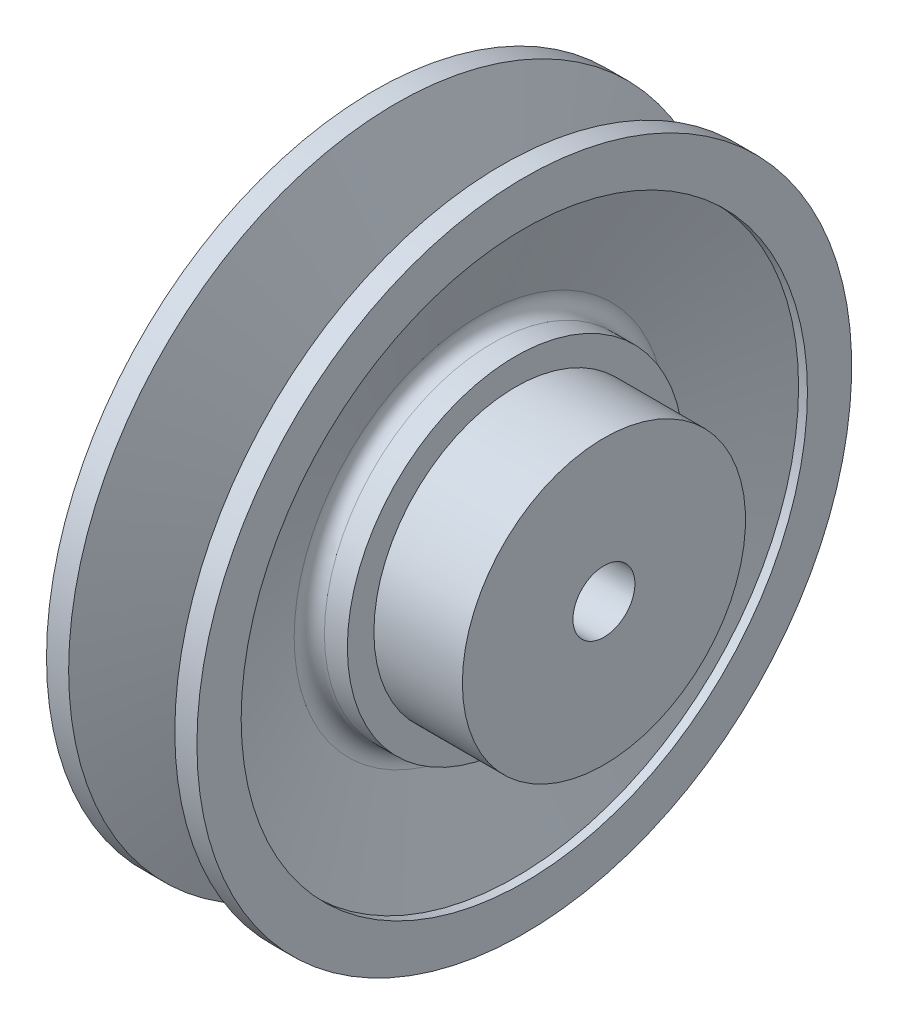
ISO-10303-21;
HEADER;
FILE_DESCRIPTION(('STEP AP214'),'2;1');
FILE_NAME('part.step','',(''),(''),'','','');
FILE_SCHEMA(('AUTOMOTIVE_DESIGN { 1 0 10303 214 1 1 1 1 }'));
ENDSEC;
DATA;
#1=APPLICATION_CONTEXT('core data for automotive mechanical design processes');
#2=APPLICATION_PROTOCOL_DEFINITION('international standard','automotive_design',2000,#1);
#3=PRODUCT_CONTEXT('',#1,'mechanical');
#4=PRODUCT('Part','Part','',(#3));
#5=PRODUCT_RELATED_PRODUCT_CATEGORY('part','',(#4));
#6=PRODUCT_DEFINITION_FORMATION('','',#4);
#7=PRODUCT_DEFINITION_CONTEXT('part definition',#1,'design');
#8=PRODUCT_DEFINITION('design','',#6,#7);
#9=PRODUCT_DEFINITION_SHAPE('','',#8);
#10=(LENGTH_UNIT() NAMED_UNIT(*) SI_UNIT(.MILLI.,.METRE.));
#11=(NAMED_UNIT(*) PLANE_ANGLE_UNIT() SI_UNIT($,.RADIAN.));
#12=(NAMED_UNIT(*) SI_UNIT($,.STERADIAN.) SOLID_ANGLE_UNIT());
#13=UNCERTAINTY_MEASURE_WITH_UNIT(LENGTH_MEASURE(1.E-05),#10,'distance_accuracy_value','');
#14=(GEOMETRIC_REPRESENTATION_CONTEXT(3) GLOBAL_UNCERTAINTY_ASSIGNED_CONTEXT((#13)) GLOBAL_UNIT_ASSIGNED_CONTEXT((#10,
#11,#12)) REPRESENTATION_CONTEXT('',''));
#15=CARTESIAN_POINT('',(0.,0.,0.));
#16=DIRECTION('',(0.,0.,1.));
#17=DIRECTION('',(1.,0.,0.));
#18=AXIS2_PLACEMENT_3D('',#15,#16,#17);
#19=CARTESIAN_POINT('',(-36.2519763918124,39.1484603049047,0.));
#20=DIRECTION('',(1.,0.,0.));
#21=DIRECTION('',(0.,0.,-1.));
#22=AXIS2_PLACEMENT_3D('',#19,#20,#21);
#23=PLANE('',#22);
#24=CARTESIAN_POINT('',(-36.2519763918124,1.14846030490472,0.));
#25=DIRECTION('',(-1.,0.,0.));
#26=DIRECTION('',(0.,0.,1.));
#27=AXIS2_PLACEMENT_3D('',#24,#25,#26);
#28=CIRCLE('',#27,7.);
#29=CARTESIAN_POINT('',(-36.2519763918124,1.14846030490472,7.));
#30=VERTEX_POINT('',#29);
#31=EDGE_CURVE('E56',#30,#30,#28,.T.);
#32=ORIENTED_EDGE('',*,*,#31,.F.);
#33=EDGE_LOOP('',(#32));
#34=FACE_BOUND('',#33,.T.);
#35=CARTESIAN_POINT('',(-36.2519763918124,1.14846030490472,0.));
#36=DIRECTION('',(-1.,0.,0.));
#37=DIRECTION('',(0.,0.,1.));
#38=AXIS2_PLACEMENT_3D('',#35,#36,#37);
#39=CIRCLE('',#38,38.);
#40=CARTESIAN_POINT('',(-36.2519763918124,1.14846030490472,38.));
#41=VERTEX_POINT('',#40);
#42=EDGE_CURVE('E95',#41,#41,#39,.T.);
#43=ORIENTED_EDGE('',*,*,#42,.T.);
#44=EDGE_LOOP('',(#43));
#45=FACE_BOUND('',#44,.T.);
#46=ADVANCED_FACE('F25',(#34,#45),#23,.F.);
#47=CARTESIAN_POINT('',(-66.2035416578656,1.14846030490472,0.));
#48=DIRECTION('',(-1.,0.,0.));
#49=DIRECTION('',(0.,0.,1.));
#50=AXIS2_PLACEMENT_3D('',#47,#48,#49);
#51=CYLINDRICAL_SURFACE('',#50,7.);
#52=CARTESIAN_POINT('',(13.7480236081876,1.14846030490472,0.));
#53=DIRECTION('',(-1.,0.,0.));
#54=DIRECTION('',(0.,0.,1.));
#55=AXIS2_PLACEMENT_3D('',#52,#53,#54);
#56=CIRCLE('',#55,7.);
#57=CARTESIAN_POINT('',(13.7480236081876,1.14846030490472,7.));
#58=VERTEX_POINT('',#57);
#59=EDGE_CURVE('E59',#58,#58,#56,.T.);
#60=ORIENTED_EDGE('',*,*,#59,.F.);
#61=EDGE_LOOP('',(#60));
#62=FACE_BOUND('',#61,.T.);
#63=ORIENTED_EDGE('',*,*,#31,.T.);
#64=EDGE_LOOP('',(#63));
#65=FACE_BOUND('',#64,.T.);
#66=ADVANCED_FACE('F115',(#62,#65),#51,.F.);
#67=CARTESIAN_POINT('',(13.7480236081876,8.14846030490472,0.));
#68=DIRECTION('',(-1.,0.,0.));
#69=DIRECTION('',(0.,0.,1.));
#70=AXIS2_PLACEMENT_3D('',#67,#68,#69);
#71=PLANE('',#70);
#72=CARTESIAN_POINT('',(13.7480236081876,1.14846030490472,0.));
#73=DIRECTION('',(-1.,0.,0.));
#74=DIRECTION('',(0.,0.,1.));
#75=AXIS2_PLACEMENT_3D('',#72,#73,#74);
#76=CIRCLE('',#75,32.);
#77=CARTESIAN_POINT('',(13.7480236081876,1.14846030490472,32.));
#78=VERTEX_POINT('',#77);
#79=EDGE_CURVE('E62',#78,#78,#76,.T.);
#80=ORIENTED_EDGE('',*,*,#79,.F.);
#81=EDGE_LOOP('',(#80));
#82=FACE_BOUND('',#81,.T.);
#83=ORIENTED_EDGE('',*,*,#59,.T.);
#84=EDGE_LOOP('',(#83));
#85=FACE_BOUND('',#84,.T.);
#86=ADVANCED_FACE('F120',(#82,#85),#71,.F.);
#87=CARTESIAN_POINT('',(-66.2035416578656,1.14846030490472,0.));
#88=DIRECTION('',(-1.,0.,0.));
#89=DIRECTION('',(0.,0.,1.));
#90=AXIS2_PLACEMENT_3D('',#87,#88,#89);
#91=CYLINDRICAL_SURFACE('',#90,32.);
#92=CARTESIAN_POINT('',(-6.25197639181239,1.14846030490472,0.));
#93=DIRECTION('',(-1.,0.,0.));
#94=DIRECTION('',(0.,0.,1.));
#95=AXIS2_PLACEMENT_3D('',#92,#93,#94);
#96=CIRCLE('',#95,32.);
#97=CARTESIAN_POINT('',(-6.25197639181239,1.14846030490472,32.));
#98=VERTEX_POINT('',#97);
#99=EDGE_CURVE('E65',#98,#98,#96,.T.);
#100=ORIENTED_EDGE('',*,*,#99,.F.);
#101=EDGE_LOOP('',(#100));
#102=FACE_BOUND('',#101,.T.);
#103=ORIENTED_EDGE('',*,*,#79,.T.);
#104=EDGE_LOOP('',(#103));
#105=FACE_BOUND('',#104,.T.);
#106=ADVANCED_FACE('F127',(#102,#105),#91,.T.);
#107=CARTESIAN_POINT('',(-6.25197639181239,33.1484603049047,0.));
#108=DIRECTION('',(-1.,0.,0.));
#109=DIRECTION('',(0.,0.,1.));
#110=AXIS2_PLACEMENT_3D('',#107,#108,#109);
#111=PLANE('',#110);
#112=CARTESIAN_POINT('',(-6.25197639181239,1.14846030490472,0.));
#113=DIRECTION('',(-1.,0.,0.));
#114=DIRECTION('',(0.,0.,1.));
#115=AXIS2_PLACEMENT_3D('',#112,#113,#114);
#116=CIRCLE('',#115,38.);
#117=CARTESIAN_POINT('',(-6.25197639181239,1.14846030490472,38.));
#118=VERTEX_POINT('',#117);
#119=EDGE_CURVE('E68',#118,#118,#116,.T.);
#120=ORIENTED_EDGE('',*,*,#119,.F.);
#121=EDGE_LOOP('',(#120));
#122=FACE_BOUND('',#121,.T.);
#123=ORIENTED_EDGE('',*,*,#99,.T.);
#124=EDGE_LOOP('',(#123));
#125=FACE_BOUND('',#124,.T.);
#126=ADVANCED_FACE('F134',(#122,#125),#111,.F.);
#127=CARTESIAN_POINT('',(-66.2035416578656,1.14846030490472,0.));
#128=DIRECTION('',(-1.,0.,0.));
#129=DIRECTION('',(0.,0.,1.));
#130=AXIS2_PLACEMENT_3D('',#127,#128,#129);
#131=CYLINDRICAL_SURFACE('',#130,38.);
#132=CARTESIAN_POINT('',(-11.4307584625072,1.14846030490472,0.));
#133=DIRECTION('',(-1.,0.,0.));
#134=DIRECTION('',(0.,0.,1.));
#135=AXIS2_PLACEMENT_3D('',#132,#133,#134);
#136=CIRCLE('',#135,38.);
#137=CARTESIAN_POINT('',(-11.4307584625072,1.14846030490472,38.));
#138=VERTEX_POINT('',#137);
#139=EDGE_CURVE('E50',#138,#138,#136,.F.);
#140=ORIENTED_EDGE('',*,*,#139,.T.);
#141=EDGE_LOOP('',(#140));
#142=FACE_BOUND('',#141,.T.);
#143=ORIENTED_EDGE('',*,*,#119,.T.);
#144=EDGE_LOOP('',(#143));
#145=FACE_BOUND('',#144,.T.);
#146=ADVANCED_FACE('F138',(#142,#145),#131,.T.);
#147=CARTESIAN_POINT('',(-15.7152024827336,1.14846030490472,0.));
#148=DIRECTION('',(1.,0.,0.));
#149=DIRECTION('',(0.,0.,-1.));
#150=AXIS2_PLACEMENT_3D('',#147,#148,#149);
#151=CONICAL_SURFACE('',#150,38.,1.22173047639603);
#152=CARTESIAN_POINT('',(-14.249836324865,1.14846030490472,0.));
#153=DIRECTION('',(1.,0.,0.));
#154=DIRECTION('',(0.,0.,-1.));
#155=AXIS2_PLACEMENT_3D('',#152,#153,#154);
#156=CIRCLE('',#155,42.026060429977);
#157=CARTESIAN_POINT('',(-14.249836324865,1.14846030490472,-42.026060429977));
#158=VERTEX_POINT('',#157);
#159=EDGE_CURVE('E53',#158,#158,#156,.F.);
#160=ORIENTED_EDGE('',*,*,#159,.T.);
#161=EDGE_LOOP('',(#160));
#162=FACE_BOUND('',#161,.T.);
#163=CARTESIAN_POINT('',(-6.25197639181239,1.14846030490472,0.));
#164=DIRECTION('',(-1.,0.,0.));
#165=DIRECTION('',(0.,0.,1.));
#166=AXIS2_PLACEMENT_3D('',#163,#164,#165);
#167=CIRCLE('',#166,64.);
#168=CARTESIAN_POINT('',(-6.25197639181239,1.14846030490472,64.));
#169=VERTEX_POINT('',#168);
#170=EDGE_CURVE('E71',#169,#169,#167,.T.);
#171=ORIENTED_EDGE('',*,*,#170,.F.);
#172=EDGE_LOOP('',(#171));
#173=FACE_BOUND('',#172,.T.);
#174=ADVANCED_FACE('F142',(#162,#173),#151,.F.);
#175=CARTESIAN_POINT('',(-66.2035416578656,1.14846030490472,0.));
#176=DIRECTION('',(-1.,0.,0.));
#177=DIRECTION('',(0.,0.,1.));
#178=AXIS2_PLACEMENT_3D('',#175,#176,#177);
#179=CYLINDRICAL_SURFACE('',#178,64.);
#180=CARTESIAN_POINT('',(-4.25197639181238,1.14846030490472,0.));
#181=DIRECTION('',(-1.,0.,0.));
#182=DIRECTION('',(0.,0.,1.));
#183=AXIS2_PLACEMENT_3D('',#180,#181,#182);
#184=CIRCLE('',#183,64.);
#185=CARTESIAN_POINT('',(-4.25197639181238,1.14846030490472,64.));
#186=VERTEX_POINT('',#185);
#187=EDGE_CURVE('E74',#186,#186,#184,.T.);
#188=ORIENTED_EDGE('',*,*,#187,.F.);
#189=EDGE_LOOP('',(#188));
#190=FACE_BOUND('',#189,.T.);
#191=ORIENTED_EDGE('',*,*,#170,.T.);
#192=EDGE_LOOP('',(#191));
#193=FACE_BOUND('',#192,.T.);
#194=ADVANCED_FACE('F146',(#190,#193),#179,.F.);
#195=CARTESIAN_POINT('',(-4.25197639181238,75.1484603049047,0.));
#196=DIRECTION('',(-1.,0.,0.));
#197=DIRECTION('',(0.,0.,1.));
#198=AXIS2_PLACEMENT_3D('',#195,#196,#197);
#199=PLANE('',#198);
#200=CARTESIAN_POINT('',(-4.25197639181239,1.14846030490472,0.));
#201=DIRECTION('',(-1.,0.,0.));
#202=DIRECTION('',(0.,0.,1.));
#203=AXIS2_PLACEMENT_3D('',#200,#201,#202);
#204=CIRCLE('',#203,74.);
#205=CARTESIAN_POINT('',(-4.25197639181239,1.14846030490472,74.));
#206=VERTEX_POINT('',#205);
#207=EDGE_CURVE('E77',#206,#206,#204,.T.);
#208=ORIENTED_EDGE('',*,*,#207,.F.);
#209=EDGE_LOOP('',(#208));
#210=FACE_BOUND('',#209,.T.);
#211=ORIENTED_EDGE('',*,*,#187,.T.);
#212=EDGE_LOOP('',(#211));
#213=FACE_BOUND('',#212,.T.);
#214=ADVANCED_FACE('F150',(#210,#213),#199,.F.);
#215=CARTESIAN_POINT('',(-66.2035416578656,1.14846030490472,0.));
#216=DIRECTION('',(-1.,0.,0.));
#217=DIRECTION('',(0.,0.,1.));
#218=AXIS2_PLACEMENT_3D('',#215,#216,#217);
#219=CYLINDRICAL_SURFACE('',#218,74.);
#220=CARTESIAN_POINT('',(-9.25197639181238,1.14846030490472,0.));
#221=DIRECTION('',(-1.,0.,0.));
#222=DIRECTION('',(0.,0.,1.));
#223=AXIS2_PLACEMENT_3D('',#220,#221,#222);
#224=CIRCLE('',#223,74.);
#225=CARTESIAN_POINT('',(-9.25197639181238,1.14846030490472,74.));
#226=VERTEX_POINT('',#225);
#227=EDGE_CURVE('E80',#226,#226,#224,.T.);
#228=ORIENTED_EDGE('',*,*,#227,.F.);
#229=EDGE_LOOP('',(#228));
#230=FACE_BOUND('',#229,.T.);
#231=ORIENTED_EDGE('',*,*,#207,.T.);
#232=EDGE_LOOP('',(#231));
#233=FACE_BOUND('',#232,.T.);
#234=ADVANCED_FACE('F154',(#230,#233),#219,.T.);
#235=CARTESIAN_POINT('',(-9.25197639181238,1.14846030490472,0.));
#236=DIRECTION('',(1.,0.,0.));
#237=DIRECTION('',(0.,0.,-1.));
#238=AXIS2_PLACEMENT_3D('',#235,#236,#237);
#239=CONICAL_SURFACE('',#238,74.,1.22173047639603);
#240=CARTESIAN_POINT('',(-17.6327770007388,1.14846030490472,0.));
#241=DIRECTION('',(1.,0.,0.));
#242=DIRECTION('',(0.,0.,-1.));
#243=AXIS2_PLACEMENT_3D('',#240,#241,#242);
#244=CIRCLE('',#243,50.973939570023);
#245=CARTESIAN_POINT('',(-17.6327770007388,1.14846030490472,-50.973939570023));
#246=VERTEX_POINT('',#245);
#247=EDGE_CURVE('E39',#246,#246,#244,.T.);
#248=ORIENTED_EDGE('',*,*,#247,.T.);
#249=EDGE_LOOP('',(#248));
#250=FACE_BOUND('',#249,.T.);
#251=ORIENTED_EDGE('',*,*,#227,.T.);
#252=EDGE_LOOP('',(#251));
#253=FACE_BOUND('',#252,.T.);
#254=ADVANCED_FACE('F158',(#250,#253),#239,.T.);
#255=CARTESIAN_POINT('',(-66.2035416578656,1.14846030490472,0.));
#256=DIRECTION('',(-1.,0.,0.));
#257=DIRECTION('',(0.,0.,1.));
#258=AXIS2_PLACEMENT_3D('',#255,#256,#257);
#259=CYLINDRICAL_SURFACE('',#258,49.);
#260=CARTESIAN_POINT('',(-20.4518548630965,1.14846030490472,0.));
#261=DIRECTION('',(-1.,0.,0.));
#262=DIRECTION('',(0.,0.,1.));
#263=AXIS2_PLACEMENT_3D('',#260,#261,#262);
#264=CIRCLE('',#263,49.);
#265=CARTESIAN_POINT('',(-20.4518548630965,1.14846030490472,49.));
#266=VERTEX_POINT('',#265);
#267=EDGE_CURVE('E44',#266,#266,#264,.T.);
#268=ORIENTED_EDGE('',*,*,#267,.T.);
#269=EDGE_LOOP('',(#268));
#270=FACE_BOUND('',#269,.T.);
#271=CARTESIAN_POINT('',(-22.0520979205283,1.14846030490472,0.));
#272=DIRECTION('',(-1.,0.,0.));
#273=DIRECTION('',(0.,0.,1.));
#274=AXIS2_PLACEMENT_3D('',#271,#272,#273);
#275=CIRCLE('',#274,49.);
#276=CARTESIAN_POINT('',(-22.0520979205283,1.14846030490472,49.));
#277=VERTEX_POINT('',#276);
#278=EDGE_CURVE('E47',#277,#277,#275,.F.);
#279=ORIENTED_EDGE('',*,*,#278,.T.);
#280=EDGE_LOOP('',(#279));
#281=FACE_BOUND('',#280,.T.);
#282=ADVANCED_FACE('F162',(#270,#281),#259,.T.);
#283=CARTESIAN_POINT('',(-24.1527205351574,1.14846030490472,0.));
#284=DIRECTION('',(-1.,0.,0.));
#285=DIRECTION('',(0.,0.,1.));
#286=AXIS2_PLACEMENT_3D('',#283,#284,#285);
#287=CONICAL_SURFACE('',#286,49.,1.22173047639603);
#288=CARTESIAN_POINT('',(-24.871175782886,1.14846030490472,0.));
#289=DIRECTION('',(-1.,0.,0.));
#290=DIRECTION('',(0.,0.,1.));
#291=AXIS2_PLACEMENT_3D('',#288,#289,#290);
#292=CIRCLE('',#291,50.973939570023);
#293=CARTESIAN_POINT('',(-24.871175782886,1.14846030490472,50.973939570023));
#294=VERTEX_POINT('',#293);
#295=EDGE_CURVE('E35',#294,#294,#292,.T.);
#296=ORIENTED_EDGE('',*,*,#295,.T.);
#297=EDGE_LOOP('',(#296));
#298=FACE_BOUND('',#297,.T.);
#299=CARTESIAN_POINT('',(-33.2519763918124,1.14846030490472,0.));
#300=DIRECTION('',(-1.,0.,0.));
#301=DIRECTION('',(0.,0.,1.));
#302=AXIS2_PLACEMENT_3D('',#299,#300,#301);
#303=CIRCLE('',#302,74.);
#304=CARTESIAN_POINT('',(-33.2519763918124,1.14846030490472,74.));
#305=VERTEX_POINT('',#304);
#306=EDGE_CURVE('E83',#305,#305,#303,.T.);
#307=ORIENTED_EDGE('',*,*,#306,.F.);
#308=EDGE_LOOP('',(#307));
#309=FACE_BOUND('',#308,.T.);
#310=ADVANCED_FACE('F166',(#298,#309),#287,.T.);
#311=CARTESIAN_POINT('',(-66.2035416578656,1.14846030490472,0.));
#312=DIRECTION('',(-1.,0.,0.));
#313=DIRECTION('',(0.,0.,1.));
#314=AXIS2_PLACEMENT_3D('',#311,#312,#313);
#315=CYLINDRICAL_SURFACE('',#314,74.);
#316=CARTESIAN_POINT('',(-38.2519763918124,1.14846030490472,0.));
#317=DIRECTION('',(-1.,0.,0.));
#318=DIRECTION('',(0.,0.,1.));
#319=AXIS2_PLACEMENT_3D('',#316,#317,#318);
#320=CIRCLE('',#319,74.);
#321=CARTESIAN_POINT('',(-38.2519763918124,1.14846030490472,74.));
#322=VERTEX_POINT('',#321);
#323=EDGE_CURVE('E86',#322,#322,#320,.T.);
#324=ORIENTED_EDGE('',*,*,#323,.F.);
#325=EDGE_LOOP('',(#324));
#326=FACE_BOUND('',#325,.T.);
#327=ORIENTED_EDGE('',*,*,#306,.T.);
#328=EDGE_LOOP('',(#327));
#329=FACE_BOUND('',#328,.T.);
#330=ADVANCED_FACE('F170',(#326,#329),#315,.T.);
#331=CARTESIAN_POINT('',(-38.2519763918124,75.1484603049047,0.));
#332=DIRECTION('',(1.,0.,0.));
#333=DIRECTION('',(0.,0.,-1.));
#334=AXIS2_PLACEMENT_3D('',#331,#332,#333);
#335=PLANE('',#334);
#336=CARTESIAN_POINT('',(-38.2519763918124,1.14846030490472,0.));
#337=DIRECTION('',(-1.,0.,0.));
#338=DIRECTION('',(0.,0.,1.));
#339=AXIS2_PLACEMENT_3D('',#336,#337,#338);
#340=CIRCLE('',#339,64.);
#341=CARTESIAN_POINT('',(-38.2519763918124,1.14846030490472,64.));
#342=VERTEX_POINT('',#341);
#343=EDGE_CURVE('E89',#342,#342,#340,.T.);
#344=ORIENTED_EDGE('',*,*,#343,.F.);
#345=EDGE_LOOP('',(#344));
#346=FACE_BOUND('',#345,.T.);
#347=ORIENTED_EDGE('',*,*,#323,.T.);
#348=EDGE_LOOP('',(#347));
#349=FACE_BOUND('',#348,.T.);
#350=ADVANCED_FACE('F174',(#346,#349),#335,.F.);
#351=CARTESIAN_POINT('',(-66.2035416578656,1.14846030490472,0.));
#352=DIRECTION('',(-1.,0.,0.));
#353=DIRECTION('',(0.,0.,1.));
#354=AXIS2_PLACEMENT_3D('',#351,#352,#353);
#355=CYLINDRICAL_SURFACE('',#354,64.);
#356=CARTESIAN_POINT('',(-36.2519763918124,1.14846030490472,0.));
#357=DIRECTION('',(-1.,0.,0.));
#358=DIRECTION('',(0.,0.,1.));
#359=AXIS2_PLACEMENT_3D('',#356,#357,#358);
#360=CIRCLE('',#359,64.);
#361=CARTESIAN_POINT('',(-36.2519763918124,1.14846030490472,64.));
#362=VERTEX_POINT('',#361);
#363=EDGE_CURVE('E92',#362,#362,#360,.T.);
#364=ORIENTED_EDGE('',*,*,#363,.F.);
#365=EDGE_LOOP('',(#364));
#366=FACE_BOUND('',#365,.T.);
#367=ORIENTED_EDGE('',*,*,#343,.T.);
#368=EDGE_LOOP('',(#367));
#369=FACE_BOUND('',#368,.T.);
#370=ADVANCED_FACE('F112',(#366,#369),#355,.F.);
#371=CARTESIAN_POINT('',(-36.2519763918124,1.14846030490472,0.));
#372=DIRECTION('',(-1.,0.,0.));
#373=DIRECTION('',(0.,0.,1.));
#374=AXIS2_PLACEMENT_3D('',#371,#372,#373);
#375=CONICAL_SURFACE('',#374,64.,1.22173047639603);
#376=CARTESIAN_POINT('',(-28.2541164587598,1.14846030490472,0.));
#377=DIRECTION('',(-1.,0.,0.));
#378=DIRECTION('',(0.,0.,1.));
#379=AXIS2_PLACEMENT_3D('',#376,#377,#378);
#380=CIRCLE('',#379,42.026060429977);
#381=CARTESIAN_POINT('',(-28.2541164587598,1.14846030490472,42.026060429977));
#382=VERTEX_POINT('',#381);
#383=EDGE_CURVE('E10',#382,#382,#380,.F.);
#384=ORIENTED_EDGE('',*,*,#383,.T.);
#385=EDGE_LOOP('',(#384));
#386=FACE_BOUND('',#385,.T.);
#387=ORIENTED_EDGE('',*,*,#363,.T.);
#388=EDGE_LOOP('',(#387));
#389=FACE_BOUND('',#388,.T.);
#390=ADVANCED_FACE('F103',(#386,#389),#375,.F.);
#391=CARTESIAN_POINT('',(-66.2035416578656,1.14846030490472,0.));
#392=DIRECTION('',(-1.,0.,0.));
#393=DIRECTION('',(0.,0.,1.));
#394=AXIS2_PLACEMENT_3D('',#391,#392,#393);
#395=CYLINDRICAL_SURFACE('',#394,38.);
#396=CARTESIAN_POINT('',(-31.0731943211175,1.14846030490472,0.));
#397=DIRECTION('',(-1.,0.,0.));
#398=DIRECTION('',(0.,0.,1.));
#399=AXIS2_PLACEMENT_3D('',#396,#397,#398);
#400=CIRCLE('',#399,38.);
#401=CARTESIAN_POINT('',(-31.0731943211175,1.14846030490472,38.));
#402=VERTEX_POINT('',#401);
#403=EDGE_CURVE('E31',#402,#402,#400,.T.);
#404=ORIENTED_EDGE('',*,*,#403,.T.);
#405=EDGE_LOOP('',(#404));
#406=FACE_BOUND('',#405,.T.);
#407=ORIENTED_EDGE('',*,*,#42,.F.);
#408=EDGE_LOOP('',(#407));
#409=FACE_BOUND('',#408,.T.);
#410=ADVANCED_FACE('F100',(#406,#409),#395,.T.);
#411=CARTESIAN_POINT('',(-11.4307584625072,1.14846030490472,0.));
#412=DIRECTION('',(-1.,0.,0.));
#413=DIRECTION('',(0.,0.,1.));
#414=AXIS2_PLACEMENT_3D('',#411,#412,#413);
#415=TOROIDAL_SURFACE('',#414,41.,3.);
#416=ORIENTED_EDGE('',*,*,#139,.F.);
#417=EDGE_LOOP('',(#416));
#418=FACE_BOUND('',#417,.T.);
#419=ORIENTED_EDGE('',*,*,#159,.F.);
#420=EDGE_LOOP('',(#419));
#421=FACE_BOUND('',#420,.T.);
#422=ADVANCED_FACE('F102',(#418,#421),#415,.F.);
#423=CARTESIAN_POINT('',(-20.4518548630965,1.14846030490472,0.));
#424=DIRECTION('',(-1.,0.,0.));
#425=DIRECTION('',(0.,0.,1.));
#426=AXIS2_PLACEMENT_3D('',#423,#424,#425);
#427=TOROIDAL_SURFACE('',#426,52.,3.);
#428=ORIENTED_EDGE('',*,*,#247,.F.);
#429=EDGE_LOOP('',(#428));
#430=FACE_BOUND('',#429,.T.);
#431=ORIENTED_EDGE('',*,*,#267,.F.);
#432=EDGE_LOOP('',(#431));
#433=FACE_BOUND('',#432,.T.);
#434=ADVANCED_FACE('F109',(#430,#433),#427,.F.);
#435=CARTESIAN_POINT('',(-22.0520979205283,1.14846030490472,0.));
#436=DIRECTION('',(-1.,0.,0.));
#437=DIRECTION('',(0.,0.,1.));
#438=AXIS2_PLACEMENT_3D('',#435,#436,#437);
#439=TOROIDAL_SURFACE('',#438,52.,3.);
#440=ORIENTED_EDGE('',*,*,#278,.F.);
#441=EDGE_LOOP('',(#440));
#442=FACE_BOUND('',#441,.T.);
#443=ORIENTED_EDGE('',*,*,#295,.F.);
#444=EDGE_LOOP('',(#443));
#445=FACE_BOUND('',#444,.T.);
#446=ADVANCED_FACE('F235',(#442,#445),#439,.F.);
#447=CARTESIAN_POINT('',(-31.0731943211175,1.14846030490472,0.));
#448=DIRECTION('',(-1.,0.,0.));
#449=DIRECTION('',(0.,0.,1.));
#450=AXIS2_PLACEMENT_3D('',#447,#448,#449);
#451=TOROIDAL_SURFACE('',#450,41.,3.);
#452=ORIENTED_EDGE('',*,*,#383,.F.);
#453=EDGE_LOOP('',(#452));
#454=FACE_BOUND('',#453,.T.);
#455=ORIENTED_EDGE('',*,*,#403,.F.);
#456=EDGE_LOOP('',(#455));
#457=FACE_BOUND('',#456,.T.);
#458=ADVANCED_FACE('F243',(#454,#457),#451,.F.);
#459=CLOSED_SHELL('',(#46,#66,#86,#106,#126,#146,#174,#194,#214,#234,#254,#282,#310,#330,#350,
#370,#390,#410,#422,#434,#446,#458));
#460=MANIFOLD_SOLID_BREP('B2',#459);
#461=ADVANCED_BREP_SHAPE_REPRESENTATION('',(#18,#460),#14);
#462=SHAPE_DEFINITION_REPRESENTATION(#9,#461);
ENDSEC;
END-ISO-10303-21;
